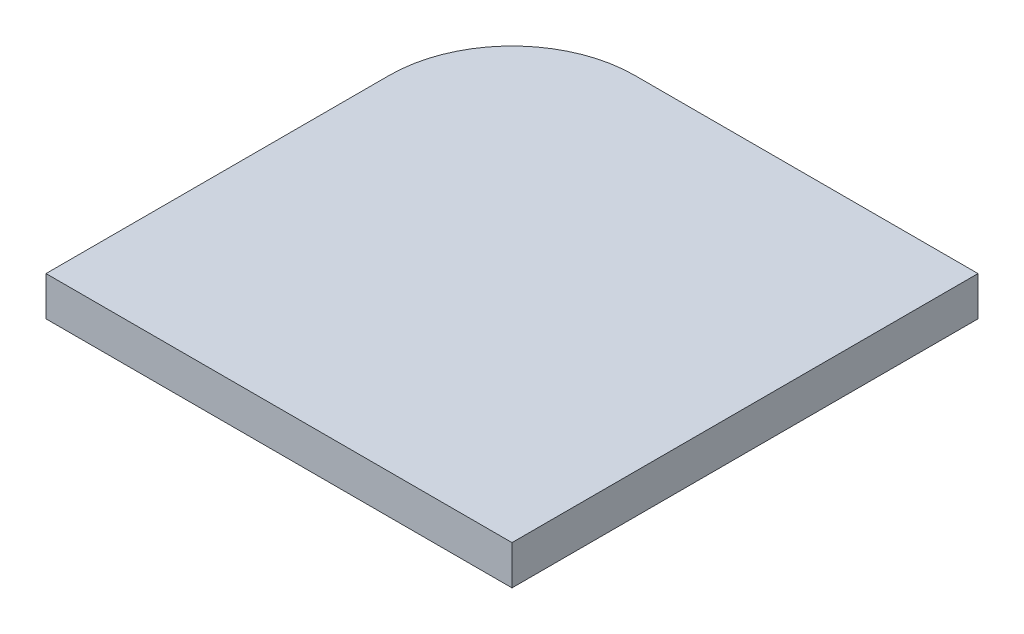
ISO-10303-21;
HEADER;
FILE_DESCRIPTION(('STEP AP214'),'2;1');
FILE_NAME('part.step','',(''),(''),'','','');
FILE_SCHEMA(('AUTOMOTIVE_DESIGN { 1 0 10303 214 1 1 1 1 }'));
ENDSEC;
DATA;
#1=APPLICATION_CONTEXT('core data for automotive mechanical design processes');
#2=APPLICATION_PROTOCOL_DEFINITION('international standard','automotive_design',2000,#1);
#3=PRODUCT_CONTEXT('',#1,'mechanical');
#4=PRODUCT('Part','Part','',(#3));
#5=PRODUCT_RELATED_PRODUCT_CATEGORY('part','',(#4));
#6=PRODUCT_DEFINITION_FORMATION('','',#4);
#7=PRODUCT_DEFINITION_CONTEXT('part definition',#1,'design');
#8=PRODUCT_DEFINITION('design','',#6,#7);
#9=PRODUCT_DEFINITION_SHAPE('','',#8);
#10=(LENGTH_UNIT() NAMED_UNIT(*) SI_UNIT(.MILLI.,.METRE.));
#11=(NAMED_UNIT(*) PLANE_ANGLE_UNIT() SI_UNIT($,.RADIAN.));
#12=(NAMED_UNIT(*) SI_UNIT($,.STERADIAN.) SOLID_ANGLE_UNIT());
#13=UNCERTAINTY_MEASURE_WITH_UNIT(LENGTH_MEASURE(1.E-05),#10,'distance_accuracy_value','');
#14=(GEOMETRIC_REPRESENTATION_CONTEXT(3) GLOBAL_UNCERTAINTY_ASSIGNED_CONTEXT((#13)) GLOBAL_UNIT_ASSIGNED_CONTEXT((#10,
#11,#12)) REPRESENTATION_CONTEXT('',''));
#15=CARTESIAN_POINT('',(0.,0.,0.));
#16=DIRECTION('',(0.,0.,1.));
#17=DIRECTION('',(1.,0.,0.));
#18=AXIS2_PLACEMENT_3D('',#15,#16,#17);
#19=CARTESIAN_POINT('',(1.33226762955019E-12,35.56,188.9125));
#20=DIRECTION('',(0.,0.,-1.));
#21=DIRECTION('',(-1.,0.,0.));
#22=AXIS2_PLACEMENT_3D('',#19,#20,#21);
#23=PLANE('',#22);
#24=DIRECTION('',(-1.,0.,0.));
#25=VECTOR('',#24,1.);
#26=CARTESIAN_POINT('',(1.33226762955019E-12,38.1,188.9125));
#27=LINE('',#26,#25);
#28=CARTESIAN_POINT('',(-822.325,38.1,188.9125));
#29=VERTEX_POINT('',#28);
#30=CARTESIAN_POINT('',(-844.55,38.1,188.9125));
#31=VERTEX_POINT('',#30);
#32=EDGE_CURVE('E111',#29,#31,#27,.T.);
#33=ORIENTED_EDGE('',*,*,#32,.F.);
#34=DIRECTION('',(0.,1.,0.));
#35=VECTOR('',#34,1.);
#36=CARTESIAN_POINT('',(-822.325,35.56,188.9125));
#37=LINE('',#36,#35);
#38=CARTESIAN_POINT('',(-822.325,35.56,188.9125));
#39=VERTEX_POINT('',#38);
#40=EDGE_CURVE('E11',#39,#29,#37,.T.);
#41=ORIENTED_EDGE('',*,*,#40,.F.);
#42=DIRECTION('',(-1.,0.,0.));
#43=VECTOR('',#42,1.);
#44=CARTESIAN_POINT('',(1.33226762955019E-12,35.56,188.9125));
#45=LINE('',#44,#43);
#46=CARTESIAN_POINT('',(-844.55,35.56,188.9125));
#47=VERTEX_POINT('',#46);
#48=EDGE_CURVE('E122',#39,#47,#45,.T.);
#49=ORIENTED_EDGE('',*,*,#48,.T.);
#50=DIRECTION('',(0.,1.,0.));
#51=VECTOR('',#50,1.);
#52=CARTESIAN_POINT('',(-844.55,35.56,188.9125));
#53=LINE('',#52,#51);
#54=EDGE_CURVE('E39',#47,#31,#53,.T.);
#55=ORIENTED_EDGE('',*,*,#54,.T.);
#56=EDGE_LOOP('',(#33,#41,#49,#55));
#57=FACE_BOUND('',#56,.T.);
#58=ADVANCED_FACE('F36',(#57),#23,.T.);
#59=CARTESIAN_POINT('',(-822.325,35.56,-2.22044604925031E-13));
#60=DIRECTION('',(1.,0.,0.));
#61=DIRECTION('',(0.,0.,-1.));
#62=AXIS2_PLACEMENT_3D('',#59,#60,#61);
#63=PLANE('',#62);
#64=DIRECTION('',(0.,0.,-1.));
#65=VECTOR('',#64,1.);
#66=CARTESIAN_POINT('',(-822.325,38.1,-2.22044604925031E-13));
#67=LINE('',#66,#65);
#68=CARTESIAN_POINT('',(-822.325,38.1,219.075));
#69=VERTEX_POINT('',#68);
#70=EDGE_CURVE('E120',#69,#29,#67,.T.);
#71=ORIENTED_EDGE('',*,*,#70,.F.);
#72=DIRECTION('',(0.,1.,0.));
#73=VECTOR('',#72,1.);
#74=CARTESIAN_POINT('',(-822.325,35.56,219.075));
#75=LINE('',#74,#73);
#76=CARTESIAN_POINT('',(-822.325,35.56,219.075));
#77=VERTEX_POINT('',#76);
#78=EDGE_CURVE('E45',#77,#69,#75,.T.);
#79=ORIENTED_EDGE('',*,*,#78,.F.);
#80=DIRECTION('',(0.,0.,-1.));
#81=VECTOR('',#80,1.);
#82=CARTESIAN_POINT('',(-822.325,35.56,-2.22044604925031E-13));
#83=LINE('',#82,#81);
#84=EDGE_CURVE('E106',#77,#39,#83,.T.);
#85=ORIENTED_EDGE('',*,*,#84,.T.);
#86=ORIENTED_EDGE('',*,*,#40,.T.);
#87=EDGE_LOOP('',(#71,#79,#85,#86));
#88=FACE_BOUND('',#87,.T.);
#89=ADVANCED_FACE('F127',(#88),#63,.T.);
#90=CARTESIAN_POINT('',(9.99200722162641E-13,35.56,219.075));
#91=DIRECTION('',(0.,0.,1.));
#92=DIRECTION('',(1.,0.,0.));
#93=AXIS2_PLACEMENT_3D('',#90,#91,#92);
#94=PLANE('',#93);
#95=DIRECTION('',(1.,0.,0.));
#96=VECTOR('',#95,1.);
#97=CARTESIAN_POINT('',(9.99200722162641E-13,38.1,219.075));
#98=LINE('',#97,#96);
#99=CARTESIAN_POINT('',(-852.4875,38.1,219.075));
#100=VERTEX_POINT('',#99);
#101=EDGE_CURVE('E93',#100,#69,#98,.T.);
#102=ORIENTED_EDGE('',*,*,#101,.F.);
#103=DIRECTION('',(0.,1.,0.));
#104=VECTOR('',#103,1.);
#105=CARTESIAN_POINT('',(-852.4875,35.56,219.075));
#106=LINE('',#105,#104);
#107=CARTESIAN_POINT('',(-852.4875,35.56,219.075));
#108=VERTEX_POINT('',#107);
#109=EDGE_CURVE('E87',#108,#100,#106,.T.);
#110=ORIENTED_EDGE('',*,*,#109,.F.);
#111=DIRECTION('',(1.,0.,0.));
#112=VECTOR('',#111,1.);
#113=CARTESIAN_POINT('',(9.99200722162641E-13,35.56,219.075));
#114=LINE('',#113,#112);
#115=EDGE_CURVE('E91',#108,#77,#114,.T.);
#116=ORIENTED_EDGE('',*,*,#115,.T.);
#117=ORIENTED_EDGE('',*,*,#78,.T.);
#118=EDGE_LOOP('',(#102,#110,#116,#117));
#119=FACE_BOUND('',#118,.T.);
#120=ADVANCED_FACE('F89',(#119),#94,.T.);
#121=CARTESIAN_POINT('',(-852.487500000001,35.56,4.02455846426619E-12));
#122=DIRECTION('',(1.,0.,0.));
#123=DIRECTION('',(0.,0.,-1.));
#124=AXIS2_PLACEMENT_3D('',#121,#122,#123);
#125=PLANE('',#124);
#126=DIRECTION('',(0.,0.,-1.));
#127=VECTOR('',#126,1.);
#128=CARTESIAN_POINT('',(-852.487500000001,38.1,4.02455846426619E-12));
#129=LINE('',#128,#127);
#130=CARTESIAN_POINT('',(-852.4875,38.1,196.85));
#131=VERTEX_POINT('',#130);
#132=EDGE_CURVE('E117',#100,#131,#129,.T.);
#133=ORIENTED_EDGE('',*,*,#132,.T.);
#134=DIRECTION('',(0.,1.,0.));
#135=VECTOR('',#134,1.);
#136=CARTESIAN_POINT('',(-852.4875,35.56,196.85));
#137=LINE('',#136,#135);
#138=CARTESIAN_POINT('',(-852.4875,35.56,196.85));
#139=VERTEX_POINT('',#138);
#140=EDGE_CURVE('E97',#139,#131,#137,.T.);
#141=ORIENTED_EDGE('',*,*,#140,.F.);
#142=DIRECTION('',(0.,0.,-1.));
#143=VECTOR('',#142,1.);
#144=CARTESIAN_POINT('',(-852.487500000001,35.56,4.02455846426619E-12));
#145=LINE('',#144,#143);
#146=EDGE_CURVE('E100',#108,#139,#145,.T.);
#147=ORIENTED_EDGE('',*,*,#146,.F.);
#148=ORIENTED_EDGE('',*,*,#109,.T.);
#149=EDGE_LOOP('',(#133,#141,#147,#148));
#150=FACE_BOUND('',#149,.T.);
#151=ADVANCED_FACE('F101',(#150),#125,.F.);
#152=CARTESIAN_POINT('',(-844.55,35.56,196.85));
#153=DIRECTION('',(0.,1.,0.));
#154=DIRECTION('',(0.,0.,1.));
#155=AXIS2_PLACEMENT_3D('',#152,#153,#154);
#156=CYLINDRICAL_SURFACE('',#155,7.93750000000008);
#157=CARTESIAN_POINT('',(-844.55,38.1,196.85));
#158=DIRECTION('',(0.,1.,0.));
#159=DIRECTION('',(0.,0.,1.));
#160=AXIS2_PLACEMENT_3D('',#157,#158,#159);
#161=CIRCLE('',#160,7.93750000000008);
#162=EDGE_CURVE('E114',#31,#131,#161,.T.);
#163=ORIENTED_EDGE('',*,*,#162,.F.);
#164=ORIENTED_EDGE('',*,*,#54,.F.);
#165=CARTESIAN_POINT('',(-844.55,35.56,196.85));
#166=DIRECTION('',(0.,1.,0.));
#167=DIRECTION('',(0.,0.,1.));
#168=AXIS2_PLACEMENT_3D('',#165,#166,#167);
#169=CIRCLE('',#168,7.93750000000008);
#170=EDGE_CURVE('E103',#47,#139,#169,.T.);
#171=ORIENTED_EDGE('',*,*,#170,.T.);
#172=ORIENTED_EDGE('',*,*,#140,.T.);
#173=EDGE_LOOP('',(#163,#164,#171,#172));
#174=FACE_BOUND('',#173,.T.);
#175=ADVANCED_FACE('F124',(#174),#156,.T.);
#176=CARTESIAN_POINT('',(9.99200722162641E-13,35.56,-4.71844785465692E-13));
#177=DIRECTION('',(0.,1.,0.));
#178=DIRECTION('',(0.,0.,1.));
#179=AXIS2_PLACEMENT_3D('',#176,#177,#178);
#180=PLANE('',#179);
#181=ORIENTED_EDGE('',*,*,#48,.F.);
#182=ORIENTED_EDGE('',*,*,#84,.F.);
#183=ORIENTED_EDGE('',*,*,#115,.F.);
#184=ORIENTED_EDGE('',*,*,#146,.T.);
#185=ORIENTED_EDGE('',*,*,#170,.F.);
#186=EDGE_LOOP('',(#181,#182,#183,#184,#185));
#187=FACE_BOUND('',#186,.T.);
#188=ADVANCED_FACE('F105',(#187),#180,.F.);
#189=CARTESIAN_POINT('',(9.99200722162641E-13,38.1,-4.71844785465692E-13));
#190=DIRECTION('',(0.,1.,0.));
#191=DIRECTION('',(0.,0.,1.));
#192=AXIS2_PLACEMENT_3D('',#189,#190,#191);
#193=PLANE('',#192);
#194=ORIENTED_EDGE('',*,*,#32,.T.);
#195=ORIENTED_EDGE('',*,*,#162,.T.);
#196=ORIENTED_EDGE('',*,*,#132,.F.);
#197=ORIENTED_EDGE('',*,*,#101,.T.);
#198=ORIENTED_EDGE('',*,*,#70,.T.);
#199=EDGE_LOOP('',(#194,#195,#196,#197,#198));
#200=FACE_BOUND('',#199,.T.);
#201=ADVANCED_FACE('F126',(#200),#193,.T.);
#202=CLOSED_SHELL('',(#58,#89,#120,#151,#175,#188,#201));
#203=MANIFOLD_SOLID_BREP('B2',#202);
#204=ADVANCED_BREP_SHAPE_REPRESENTATION('',(#18,#203),#14);
#205=SHAPE_DEFINITION_REPRESENTATION(#9,#204);
ENDSEC;
END-ISO-10303-21;
